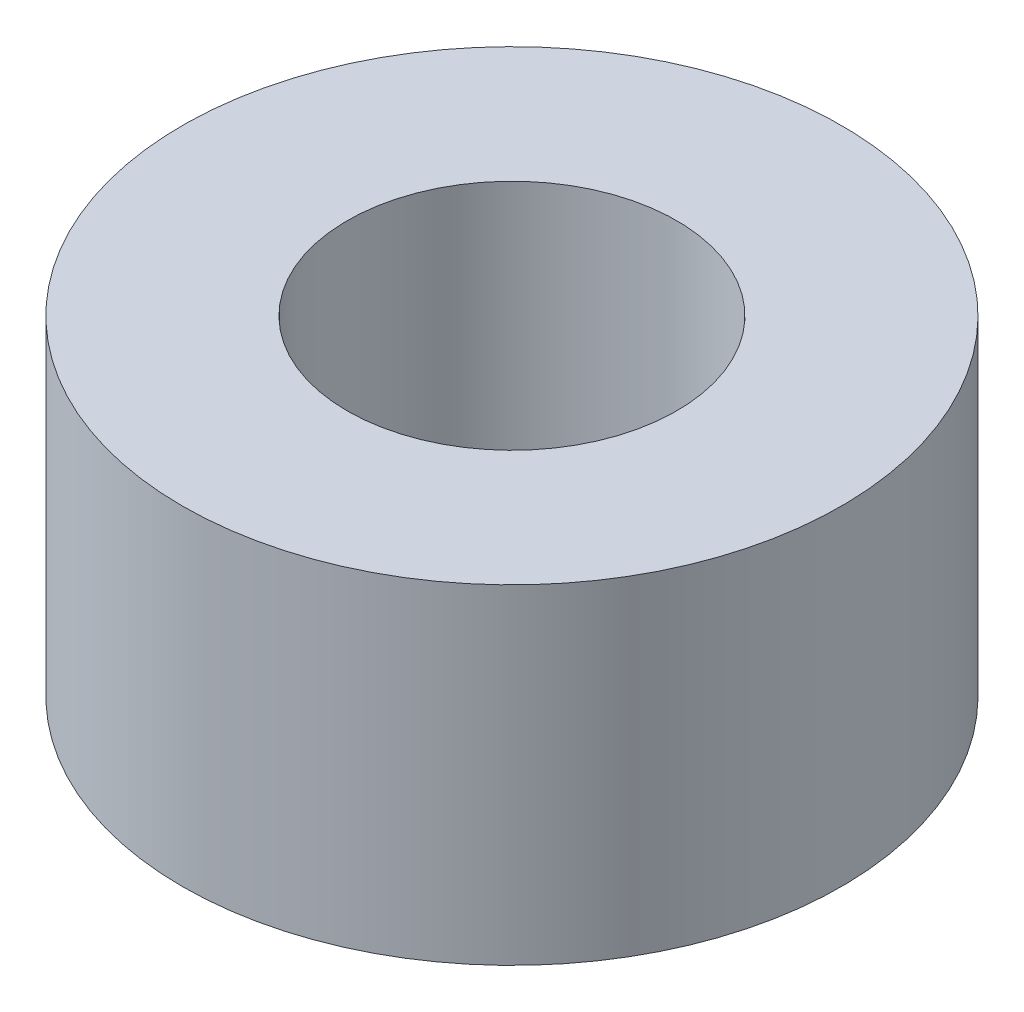
ISO-10303-21;
HEADER;
FILE_DESCRIPTION(('STEP AP214'),'2;1');
FILE_NAME('part.step','',(''),(''),'','','');
FILE_SCHEMA(('AUTOMOTIVE_DESIGN { 1 0 10303 214 1 1 1 1 }'));
ENDSEC;
DATA;
#1=APPLICATION_CONTEXT('core data for automotive mechanical design processes');
#2=APPLICATION_PROTOCOL_DEFINITION('international standard','automotive_design',2000,#1);
#3=PRODUCT_CONTEXT('',#1,'mechanical');
#4=PRODUCT('Part','Part','',(#3));
#5=PRODUCT_RELATED_PRODUCT_CATEGORY('part','',(#4));
#6=PRODUCT_DEFINITION_FORMATION('','',#4);
#7=PRODUCT_DEFINITION_CONTEXT('part definition',#1,'design');
#8=PRODUCT_DEFINITION('design','',#6,#7);
#9=PRODUCT_DEFINITION_SHAPE('','',#8);
#10=(LENGTH_UNIT() NAMED_UNIT(*) SI_UNIT(.MILLI.,.METRE.));
#11=(NAMED_UNIT(*) PLANE_ANGLE_UNIT() SI_UNIT($,.RADIAN.));
#12=(NAMED_UNIT(*) SI_UNIT($,.STERADIAN.) SOLID_ANGLE_UNIT());
#13=UNCERTAINTY_MEASURE_WITH_UNIT(LENGTH_MEASURE(1.E-05),#10,'distance_accuracy_value','');
#14=(GEOMETRIC_REPRESENTATION_CONTEXT(3) GLOBAL_UNCERTAINTY_ASSIGNED_CONTEXT((#13)) GLOBAL_UNIT_ASSIGNED_CONTEXT((#10,
#11,#12)) REPRESENTATION_CONTEXT('',''));
#15=CARTESIAN_POINT('',(0.,0.,0.));
#16=DIRECTION('',(0.,0.,1.));
#17=DIRECTION('',(1.,0.,0.));
#18=AXIS2_PLACEMENT_3D('',#15,#16,#17);
#19=CARTESIAN_POINT('',(0.,3.,0.));
#20=DIRECTION('',(0.,-1.,0.));
#21=DIRECTION('',(0.,0.,-1.));
#22=AXIS2_PLACEMENT_3D('',#19,#20,#21);
#23=CYLINDRICAL_SURFACE('',#22,3.);
#24=CARTESIAN_POINT('',(0.,3.,0.));
#25=DIRECTION('',(0.,1.,0.));
#26=DIRECTION('',(0.,0.,1.));
#27=AXIS2_PLACEMENT_3D('',#24,#25,#26);
#28=CIRCLE('',#27,3.);
#29=CARTESIAN_POINT('',(0.,3.,3.));
#30=VERTEX_POINT('',#29);
#31=EDGE_CURVE('E10',#30,#30,#28,.T.);
#32=ORIENTED_EDGE('',*,*,#31,.F.);
#33=EDGE_LOOP('',(#32));
#34=FACE_BOUND('',#33,.T.);
#35=CARTESIAN_POINT('',(0.,0.,0.));
#36=DIRECTION('',(0.,1.,0.));
#37=DIRECTION('',(0.,0.,1.));
#38=AXIS2_PLACEMENT_3D('',#35,#36,#37);
#39=CIRCLE('',#38,3.);
#40=CARTESIAN_POINT('',(0.,0.,3.));
#41=VERTEX_POINT('',#40);
#42=EDGE_CURVE('E34',#41,#41,#39,.T.);
#43=ORIENTED_EDGE('',*,*,#42,.T.);
#44=EDGE_LOOP('',(#43));
#45=FACE_BOUND('',#44,.T.);
#46=ADVANCED_FACE('F31',(#34,#45),#23,.T.);
#47=CARTESIAN_POINT('',(0.,3.,0.));
#48=DIRECTION('',(0.,1.,0.));
#49=DIRECTION('',(0.,0.,1.));
#50=AXIS2_PLACEMENT_3D('',#47,#48,#49);
#51=PLANE('',#50);
#52=CARTESIAN_POINT('',(0.,3.,0.));
#53=DIRECTION('',(0.,1.,0.));
#54=DIRECTION('',(0.,0.,1.));
#55=AXIS2_PLACEMENT_3D('',#52,#53,#54);
#56=CIRCLE('',#55,1.5);
#57=CARTESIAN_POINT('',(0.,3.,1.5));
#58=VERTEX_POINT('',#57);
#59=EDGE_CURVE('E45',#58,#58,#56,.T.);
#60=ORIENTED_EDGE('',*,*,#59,.F.);
#61=EDGE_LOOP('',(#60));
#62=FACE_BOUND('',#61,.T.);
#63=ORIENTED_EDGE('',*,*,#31,.T.);
#64=EDGE_LOOP('',(#63));
#65=FACE_BOUND('',#64,.T.);
#66=ADVANCED_FACE('F51',(#62,#65),#51,.T.);
#67=CARTESIAN_POINT('',(0.,0.,0.));
#68=DIRECTION('',(0.,1.,0.));
#69=DIRECTION('',(0.,0.,1.));
#70=AXIS2_PLACEMENT_3D('',#67,#68,#69);
#71=PLANE('',#70);
#72=CARTESIAN_POINT('',(0.,0.,0.));
#73=DIRECTION('',(0.,1.,0.));
#74=DIRECTION('',(0.,0.,1.));
#75=AXIS2_PLACEMENT_3D('',#72,#73,#74);
#76=CIRCLE('',#75,1.5);
#77=CARTESIAN_POINT('',(0.,0.,1.5));
#78=VERTEX_POINT('',#77);
#79=EDGE_CURVE('E41',#78,#78,#76,.F.);
#80=ORIENTED_EDGE('',*,*,#79,.F.);
#81=EDGE_LOOP('',(#80));
#82=FACE_BOUND('',#81,.T.);
#83=ORIENTED_EDGE('',*,*,#42,.F.);
#84=EDGE_LOOP('',(#83));
#85=FACE_BOUND('',#84,.T.);
#86=ADVANCED_FACE('F53',(#82,#85),#71,.F.);
#87=CARTESIAN_POINT('',(0.,-4.24264068711929,0.));
#88=DIRECTION('',(0.,1.,0.));
#89=DIRECTION('',(0.,0.,1.));
#90=AXIS2_PLACEMENT_3D('',#87,#88,#89);
#91=CYLINDRICAL_SURFACE('',#90,1.5);
#92=ORIENTED_EDGE('',*,*,#79,.T.);
#93=EDGE_LOOP('',(#92));
#94=FACE_BOUND('',#93,.T.);
#95=ORIENTED_EDGE('',*,*,#59,.T.);
#96=EDGE_LOOP('',(#95));
#97=FACE_BOUND('',#96,.T.);
#98=ADVANCED_FACE('F49',(#94,#97),#91,.F.);
#99=CLOSED_SHELL('',(#46,#66,#86,#98));
#100=MANIFOLD_SOLID_BREP('B2',#99);
#101=ADVANCED_BREP_SHAPE_REPRESENTATION('',(#18,#100),#14);
#102=SHAPE_DEFINITION_REPRESENTATION(#9,#101);
ENDSEC;
END-ISO-10303-21;
